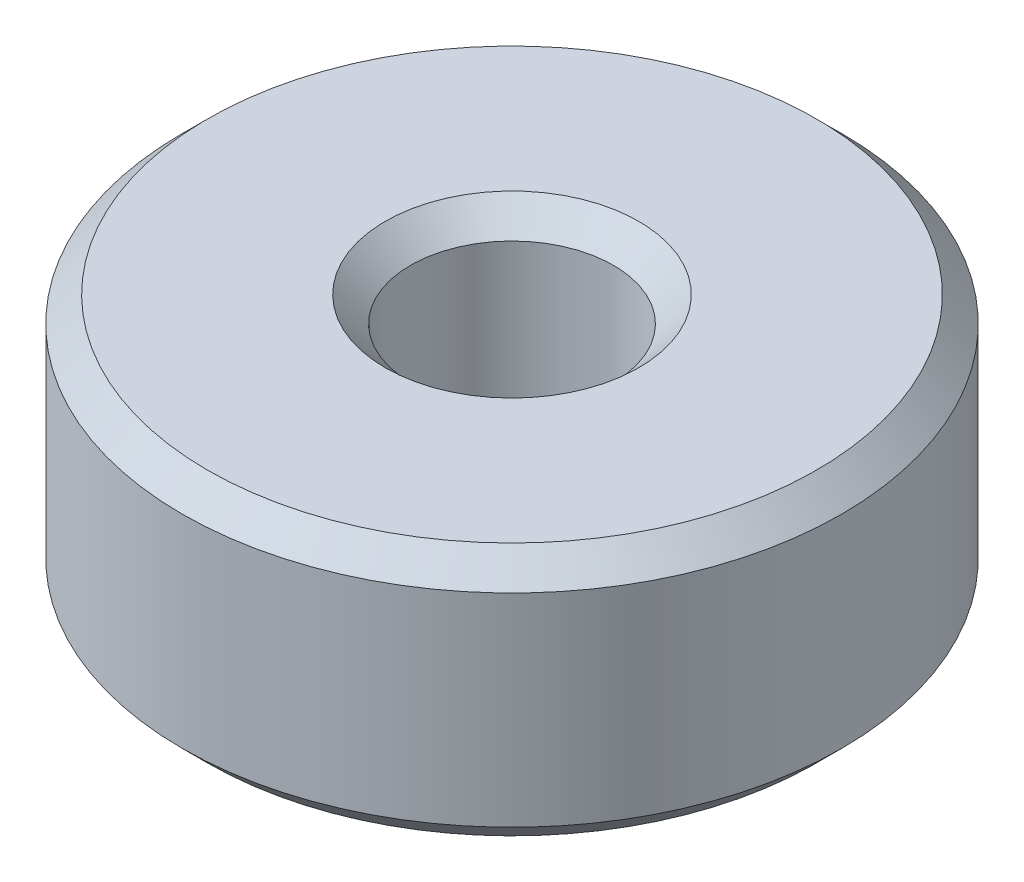
ISO-10303-21;
HEADER;
FILE_DESCRIPTION(('STEP AP214'),'2;1');
FILE_NAME('part.step','',(''),(''),'','','');
FILE_SCHEMA(('AUTOMOTIVE_DESIGN { 1 0 10303 214 1 1 1 1 }'));
ENDSEC;
DATA;
#1=APPLICATION_CONTEXT('core data for automotive mechanical design processes');
#2=APPLICATION_PROTOCOL_DEFINITION('international standard','automotive_design',2000,#1);
#3=PRODUCT_CONTEXT('',#1,'mechanical');
#4=PRODUCT('Part','Part','',(#3));
#5=PRODUCT_RELATED_PRODUCT_CATEGORY('part','',(#4));
#6=PRODUCT_DEFINITION_FORMATION('','',#4);
#7=PRODUCT_DEFINITION_CONTEXT('part definition',#1,'design');
#8=PRODUCT_DEFINITION('design','',#6,#7);
#9=PRODUCT_DEFINITION_SHAPE('','',#8);
#10=(LENGTH_UNIT() NAMED_UNIT(*) SI_UNIT(.MILLI.,.METRE.));
#11=(NAMED_UNIT(*) PLANE_ANGLE_UNIT() SI_UNIT($,.RADIAN.));
#12=(NAMED_UNIT(*) SI_UNIT($,.STERADIAN.) SOLID_ANGLE_UNIT());
#13=UNCERTAINTY_MEASURE_WITH_UNIT(LENGTH_MEASURE(1.E-05),#10,'distance_accuracy_value','');
#14=(GEOMETRIC_REPRESENTATION_CONTEXT(3) GLOBAL_UNCERTAINTY_ASSIGNED_CONTEXT((#13)) GLOBAL_UNIT_ASSIGNED_CONTEXT((#10,
#11,#12)) REPRESENTATION_CONTEXT('',''));
#15=CARTESIAN_POINT('',(0.,0.,0.));
#16=DIRECTION('',(0.,0.,1.));
#17=DIRECTION('',(1.,0.,0.));
#18=AXIS2_PLACEMENT_3D('',#15,#16,#17);
#19=CARTESIAN_POINT('',(0.,5.,0.));
#20=DIRECTION('',(0.,1.,0.));
#21=DIRECTION('',(0.,0.,1.));
#22=AXIS2_PLACEMENT_3D('',#19,#20,#21);
#23=PLANE('',#22);
#24=CARTESIAN_POINT('',(0.,5.,0.));
#25=DIRECTION('',(0.,1.,0.));
#26=DIRECTION('',(0.,0.,1.));
#27=AXIS2_PLACEMENT_3D('',#24,#25,#26);
#28=CIRCLE('',#27,2.5);
#29=CARTESIAN_POINT('',(0.,5.,2.5));
#30=VERTEX_POINT('',#29);
#31=EDGE_CURVE('E48',#30,#30,#28,.F.);
#32=ORIENTED_EDGE('',*,*,#31,.T.);
#33=EDGE_LOOP('',(#32));
#34=FACE_BOUND('',#33,.T.);
#35=CARTESIAN_POINT('',(0.,5.,0.));
#36=DIRECTION('',(0.,1.,0.));
#37=DIRECTION('',(0.,0.,1.));
#38=AXIS2_PLACEMENT_3D('',#35,#36,#37);
#39=CIRCLE('',#38,6.);
#40=CARTESIAN_POINT('',(0.,5.,6.));
#41=VERTEX_POINT('',#40);
#42=EDGE_CURVE('E52',#41,#41,#39,.T.);
#43=ORIENTED_EDGE('',*,*,#42,.T.);
#44=EDGE_LOOP('',(#43));
#45=FACE_BOUND('',#44,.T.);
#46=ADVANCED_FACE('F36',(#34,#45),#23,.T.);
#47=CARTESIAN_POINT('',(0.,0.,0.));
#48=DIRECTION('',(0.,1.,0.));
#49=DIRECTION('',(0.,0.,1.));
#50=AXIS2_PLACEMENT_3D('',#47,#48,#49);
#51=PLANE('',#50);
#52=CARTESIAN_POINT('',(0.,0.,0.));
#53=DIRECTION('',(0.,1.,0.));
#54=DIRECTION('',(0.,0.,1.));
#55=AXIS2_PLACEMENT_3D('',#52,#53,#54);
#56=CIRCLE('',#55,2.5);
#57=CARTESIAN_POINT('',(0.,0.,2.5));
#58=VERTEX_POINT('',#57);
#59=EDGE_CURVE('E63',#58,#58,#56,.T.);
#60=ORIENTED_EDGE('',*,*,#59,.T.);
#61=EDGE_LOOP('',(#60));
#62=FACE_BOUND('',#61,.T.);
#63=CARTESIAN_POINT('',(0.,0.,0.));
#64=DIRECTION('',(0.,1.,0.));
#65=DIRECTION('',(0.,0.,1.));
#66=AXIS2_PLACEMENT_3D('',#63,#64,#65);
#67=CIRCLE('',#66,6.);
#68=CARTESIAN_POINT('',(0.,0.,6.));
#69=VERTEX_POINT('',#68);
#70=EDGE_CURVE('E66',#69,#69,#67,.F.);
#71=ORIENTED_EDGE('',*,*,#70,.T.);
#72=EDGE_LOOP('',(#71));
#73=FACE_BOUND('',#72,.T.);
#74=ADVANCED_FACE('F70',(#62,#73),#51,.F.);
#75=CARTESIAN_POINT('',(0.,5.,0.));
#76=DIRECTION('',(0.,-1.,0.));
#77=DIRECTION('',(0.,0.,-1.));
#78=AXIS2_PLACEMENT_3D('',#75,#76,#77);
#79=CYLINDRICAL_SURFACE('',#78,6.5);
#80=CARTESIAN_POINT('',(0.,0.5,0.));
#81=DIRECTION('',(0.,1.,0.));
#82=DIRECTION('',(0.,0.,1.));
#83=AXIS2_PLACEMENT_3D('',#80,#81,#82);
#84=CIRCLE('',#83,6.5);
#85=CARTESIAN_POINT('',(0.,0.5,6.5));
#86=VERTEX_POINT('',#85);
#87=EDGE_CURVE('E10',#86,#86,#84,.T.);
#88=ORIENTED_EDGE('',*,*,#87,.T.);
#89=EDGE_LOOP('',(#88));
#90=FACE_BOUND('',#89,.T.);
#91=CARTESIAN_POINT('',(0.,4.5,0.));
#92=DIRECTION('',(0.,1.,0.));
#93=DIRECTION('',(0.,0.,1.));
#94=AXIS2_PLACEMENT_3D('',#91,#92,#93);
#95=CIRCLE('',#94,6.5);
#96=CARTESIAN_POINT('',(0.,4.5,6.5));
#97=VERTEX_POINT('',#96);
#98=EDGE_CURVE('E44',#97,#97,#95,.F.);
#99=ORIENTED_EDGE('',*,*,#98,.T.);
#100=EDGE_LOOP('',(#99));
#101=FACE_BOUND('',#100,.T.);
#102=ADVANCED_FACE('F91',(#90,#101),#79,.T.);
#103=CARTESIAN_POINT('',(0.,5.,0.));
#104=DIRECTION('',(0.,-1.,0.));
#105=DIRECTION('',(0.,0.,-1.));
#106=AXIS2_PLACEMENT_3D('',#103,#104,#105);
#107=CYLINDRICAL_SURFACE('',#106,2.);
#108=CARTESIAN_POINT('',(0.,0.499999999999999,0.));
#109=DIRECTION('',(0.,1.,0.));
#110=DIRECTION('',(0.,0.,1.));
#111=AXIS2_PLACEMENT_3D('',#108,#109,#110);
#112=CIRCLE('',#111,2.);
#113=CARTESIAN_POINT('',(0.,0.499999999999999,2.));
#114=VERTEX_POINT('',#113);
#115=EDGE_CURVE('E57',#114,#114,#112,.F.);
#116=ORIENTED_EDGE('',*,*,#115,.T.);
#117=EDGE_LOOP('',(#116));
#118=FACE_BOUND('',#117,.T.);
#119=CARTESIAN_POINT('',(0.,4.5,0.));
#120=DIRECTION('',(0.,1.,0.));
#121=DIRECTION('',(0.,0.,1.));
#122=AXIS2_PLACEMENT_3D('',#119,#120,#121);
#123=CIRCLE('',#122,2.);
#124=CARTESIAN_POINT('',(0.,4.5,2.));
#125=VERTEX_POINT('',#124);
#126=EDGE_CURVE('E60',#125,#125,#123,.T.);
#127=ORIENTED_EDGE('',*,*,#126,.T.);
#128=EDGE_LOOP('',(#127));
#129=FACE_BOUND('',#128,.T.);
#130=ADVANCED_FACE('F96',(#118,#129),#107,.F.);
#131=CARTESIAN_POINT('',(0.,0.,0.));
#132=DIRECTION('',(0.,-1.,0.));
#133=DIRECTION('',(0.,0.,-1.));
#134=AXIS2_PLACEMENT_3D('',#131,#132,#133);
#135=CONICAL_SURFACE('',#134,2.5,0.785398163397447);
#136=ORIENTED_EDGE('',*,*,#115,.F.);
#137=EDGE_LOOP('',(#136));
#138=FACE_BOUND('',#137,.T.);
#139=ORIENTED_EDGE('',*,*,#59,.F.);
#140=EDGE_LOOP('',(#139));
#141=FACE_BOUND('',#140,.T.);
#142=ADVANCED_FACE('F81',(#138,#141),#135,.F.);
#143=CARTESIAN_POINT('',(0.,4.5,0.));
#144=DIRECTION('',(0.,1.,0.));
#145=DIRECTION('',(0.,0.,1.));
#146=AXIS2_PLACEMENT_3D('',#143,#144,#145);
#147=CONICAL_SURFACE('',#146,2.,0.78539816339745);
#148=ORIENTED_EDGE('',*,*,#31,.F.);
#149=EDGE_LOOP('',(#148));
#150=FACE_BOUND('',#149,.T.);
#151=ORIENTED_EDGE('',*,*,#126,.F.);
#152=EDGE_LOOP('',(#151));
#153=FACE_BOUND('',#152,.T.);
#154=ADVANCED_FACE('F75',(#150,#153),#147,.F.);
#155=CARTESIAN_POINT('',(0.,0.5,0.));
#156=DIRECTION('',(0.,1.,0.));
#157=DIRECTION('',(0.,0.,1.));
#158=AXIS2_PLACEMENT_3D('',#155,#156,#157);
#159=CONICAL_SURFACE('',#158,6.5,0.785398163397451);
#160=ORIENTED_EDGE('',*,*,#70,.F.);
#161=EDGE_LOOP('',(#160));
#162=FACE_BOUND('',#161,.T.);
#163=ORIENTED_EDGE('',*,*,#87,.F.);
#164=EDGE_LOOP('',(#163));
#165=FACE_BOUND('',#164,.T.);
#166=ADVANCED_FACE('F72',(#162,#165),#159,.T.);
#167=CARTESIAN_POINT('',(0.,5.,0.));
#168=DIRECTION('',(0.,-1.,0.));
#169=DIRECTION('',(0.,0.,-1.));
#170=AXIS2_PLACEMENT_3D('',#167,#168,#169);
#171=CONICAL_SURFACE('',#170,6.,0.785398163397447);
#172=ORIENTED_EDGE('',*,*,#98,.F.);
#173=EDGE_LOOP('',(#172));
#174=FACE_BOUND('',#173,.T.);
#175=ORIENTED_EDGE('',*,*,#42,.F.);
#176=EDGE_LOOP('',(#175));
#177=FACE_BOUND('',#176,.T.);
#178=ADVANCED_FACE('F39',(#174,#177),#171,.T.);
#179=CLOSED_SHELL('',(#46,#74,#102,#130,#142,#154,#166,#178));
#180=MANIFOLD_SOLID_BREP('B2',#179);
#181=ADVANCED_BREP_SHAPE_REPRESENTATION('',(#18,#180),#14);
#182=SHAPE_DEFINITION_REPRESENTATION(#9,#181);
ENDSEC;
END-ISO-10303-21;
